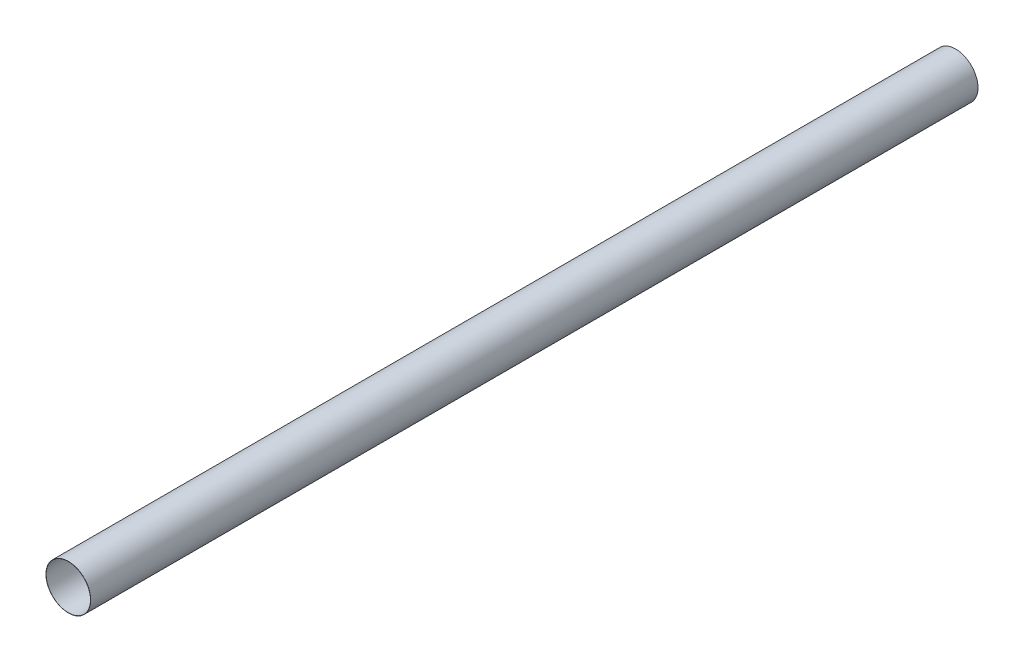
ISO-10303-21;
HEADER;
FILE_DESCRIPTION(('STEP AP214'),'2;1');
FILE_NAME('part.step','',(''),(''),'','','');
FILE_SCHEMA(('AUTOMOTIVE_DESIGN { 1 0 10303 214 1 1 1 1 }'));
ENDSEC;
DATA;
#1=APPLICATION_CONTEXT('core data for automotive mechanical design processes');
#2=APPLICATION_PROTOCOL_DEFINITION('international standard','automotive_design',2000,#1);
#3=PRODUCT_CONTEXT('',#1,'mechanical');
#4=PRODUCT('Part','Part','',(#3));
#5=PRODUCT_RELATED_PRODUCT_CATEGORY('part','',(#4));
#6=PRODUCT_DEFINITION_FORMATION('','',#4);
#7=PRODUCT_DEFINITION_CONTEXT('part definition',#1,'design');
#8=PRODUCT_DEFINITION('design','',#6,#7);
#9=PRODUCT_DEFINITION_SHAPE('','',#8);
#10=(LENGTH_UNIT() NAMED_UNIT(*) SI_UNIT(.MILLI.,.METRE.));
#11=(NAMED_UNIT(*) PLANE_ANGLE_UNIT() SI_UNIT($,.RADIAN.));
#12=(NAMED_UNIT(*) SI_UNIT($,.STERADIAN.) SOLID_ANGLE_UNIT());
#13=UNCERTAINTY_MEASURE_WITH_UNIT(LENGTH_MEASURE(1.E-05),#10,'distance_accuracy_value','');
#14=(GEOMETRIC_REPRESENTATION_CONTEXT(3) GLOBAL_UNCERTAINTY_ASSIGNED_CONTEXT((#13)) GLOBAL_UNIT_ASSIGNED_CONTEXT((#10,
#11,#12)) REPRESENTATION_CONTEXT('',''));
#15=CARTESIAN_POINT('',(0.,0.,0.));
#16=DIRECTION('',(0.,0.,1.));
#17=DIRECTION('',(1.,0.,0.));
#18=AXIS2_PLACEMENT_3D('',#15,#16,#17);
#19=CARTESIAN_POINT('',(0.,0.,10000.));
#20=DIRECTION('',(0.,0.,1.));
#21=DIRECTION('',(1.,0.,0.));
#22=AXIS2_PLACEMENT_3D('',#19,#20,#21);
#23=PLANE('',#22);
#24=CARTESIAN_POINT('',(0.,0.,10000.));
#25=DIRECTION('',(0.,0.,1.));
#26=DIRECTION('',(1.,0.,0.));
#27=AXIS2_PLACEMENT_3D('',#24,#25,#26);
#28=CIRCLE('',#27,252.);
#29=CARTESIAN_POINT('',(252.,0.,10000.));
#30=VERTEX_POINT('',#29);
#31=EDGE_CURVE('E10',#30,#30,#28,.T.);
#32=ORIENTED_EDGE('',*,*,#31,.T.);
#33=EDGE_LOOP('',(#32));
#34=FACE_BOUND('',#33,.T.);
#35=CARTESIAN_POINT('',(0.,0.,10000.));
#36=DIRECTION('',(0.,0.,1.));
#37=DIRECTION('',(1.,0.,0.));
#38=AXIS2_PLACEMENT_3D('',#35,#36,#37);
#39=CIRCLE('',#38,250.);
#40=CARTESIAN_POINT('',(250.,0.,10000.));
#41=VERTEX_POINT('',#40);
#42=EDGE_CURVE('E52',#41,#41,#39,.T.);
#43=ORIENTED_EDGE('',*,*,#42,.F.);
#44=EDGE_LOOP('',(#43));
#45=FACE_BOUND('',#44,.T.);
#46=ADVANCED_FACE('F41',(#34,#45),#23,.T.);
#47=CARTESIAN_POINT('',(0.,0.,0.));
#48=DIRECTION('',(0.,0.,1.));
#49=DIRECTION('',(1.,0.,0.));
#50=AXIS2_PLACEMENT_3D('',#47,#48,#49);
#51=PLANE('',#50);
#52=CARTESIAN_POINT('',(0.,0.,0.));
#53=DIRECTION('',(0.,0.,1.));
#54=DIRECTION('',(1.,0.,0.));
#55=AXIS2_PLACEMENT_3D('',#52,#53,#54);
#56=CIRCLE('',#55,252.);
#57=CARTESIAN_POINT('',(252.,0.,0.));
#58=VERTEX_POINT('',#57);
#59=EDGE_CURVE('E45',#58,#58,#56,.T.);
#60=ORIENTED_EDGE('',*,*,#59,.F.);
#61=EDGE_LOOP('',(#60));
#62=FACE_BOUND('',#61,.T.);
#63=CARTESIAN_POINT('',(0.,0.,0.));
#64=DIRECTION('',(0.,0.,1.));
#65=DIRECTION('',(1.,0.,0.));
#66=AXIS2_PLACEMENT_3D('',#63,#64,#65);
#67=CIRCLE('',#66,250.);
#68=CARTESIAN_POINT('',(250.,0.,0.));
#69=VERTEX_POINT('',#68);
#70=EDGE_CURVE('E54',#69,#69,#67,.T.);
#71=ORIENTED_EDGE('',*,*,#70,.T.);
#72=EDGE_LOOP('',(#71));
#73=FACE_BOUND('',#72,.T.);
#74=ADVANCED_FACE('F64',(#62,#73),#51,.F.);
#75=CARTESIAN_POINT('',(0.,0.,10000.));
#76=DIRECTION('',(0.,0.,-1.));
#77=DIRECTION('',(-1.,0.,0.));
#78=AXIS2_PLACEMENT_3D('',#75,#76,#77);
#79=CYLINDRICAL_SURFACE('',#78,252.);
#80=ORIENTED_EDGE('',*,*,#31,.F.);
#81=EDGE_LOOP('',(#80));
#82=FACE_BOUND('',#81,.T.);
#83=ORIENTED_EDGE('',*,*,#59,.T.);
#84=EDGE_LOOP('',(#83));
#85=FACE_BOUND('',#84,.T.);
#86=ADVANCED_FACE('F43',(#82,#85),#79,.T.);
#87=CARTESIAN_POINT('',(0.,0.,10000.));
#88=DIRECTION('',(0.,0.,-1.));
#89=DIRECTION('',(-1.,0.,0.));
#90=AXIS2_PLACEMENT_3D('',#87,#88,#89);
#91=CYLINDRICAL_SURFACE('',#90,250.);
#92=ORIENTED_EDGE('',*,*,#42,.T.);
#93=EDGE_LOOP('',(#92));
#94=FACE_BOUND('',#93,.T.);
#95=ORIENTED_EDGE('',*,*,#70,.F.);
#96=EDGE_LOOP('',(#95));
#97=FACE_BOUND('',#96,.T.);
#98=ADVANCED_FACE('F60',(#94,#97),#91,.F.);
#99=CLOSED_SHELL('',(#46,#74,#86,#98));
#100=MANIFOLD_SOLID_BREP('B2',#99);
#101=ADVANCED_BREP_SHAPE_REPRESENTATION('',(#18,#100),#14);
#102=SHAPE_DEFINITION_REPRESENTATION(#9,#101);
ENDSEC;
END-ISO-10303-21;
